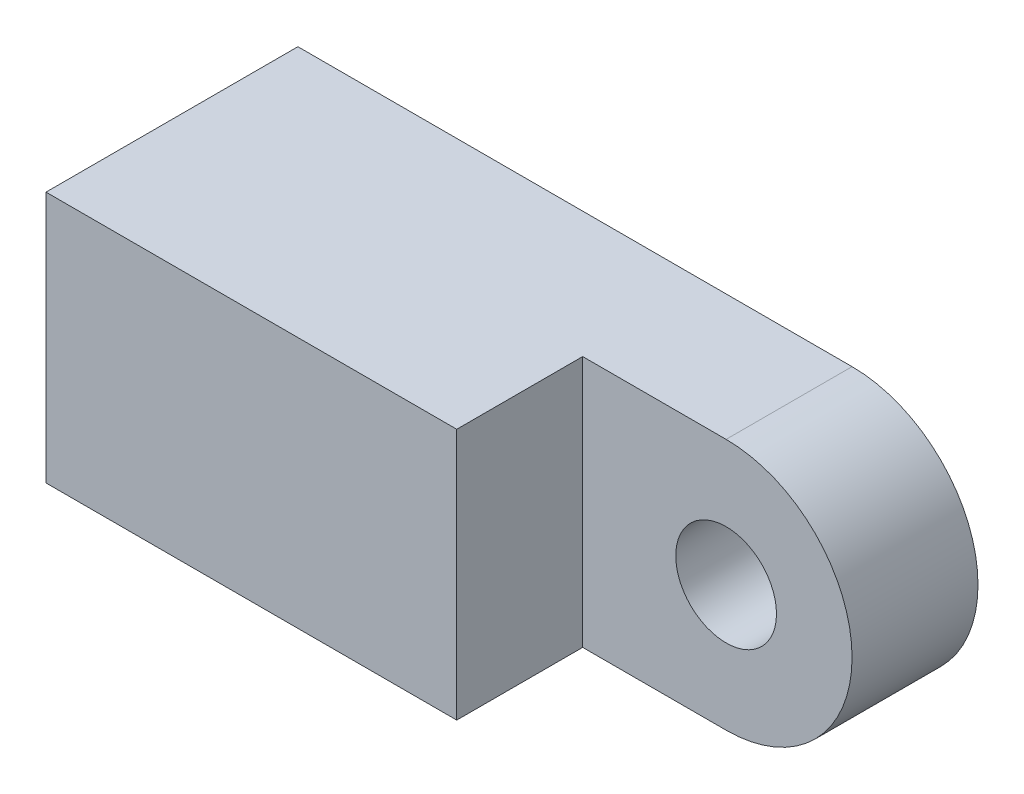
ISO-10303-21;
HEADER;
FILE_DESCRIPTION(('STEP AP214'),'2;1');
FILE_NAME('part.step','',(''),(''),'','','');
FILE_SCHEMA(('AUTOMOTIVE_DESIGN { 1 0 10303 214 1 1 1 1 }'));
ENDSEC;
DATA;
#1=APPLICATION_CONTEXT('core data for automotive mechanical design processes');
#2=APPLICATION_PROTOCOL_DEFINITION('international standard','automotive_design',2000,#1);
#3=PRODUCT_CONTEXT('',#1,'mechanical');
#4=PRODUCT('Part','Part','',(#3));
#5=PRODUCT_RELATED_PRODUCT_CATEGORY('part','',(#4));
#6=PRODUCT_DEFINITION_FORMATION('','',#4);
#7=PRODUCT_DEFINITION_CONTEXT('part definition',#1,'design');
#8=PRODUCT_DEFINITION('design','',#6,#7);
#9=PRODUCT_DEFINITION_SHAPE('','',#8);
#10=(LENGTH_UNIT() NAMED_UNIT(*) SI_UNIT(.MILLI.,.METRE.));
#11=(NAMED_UNIT(*) PLANE_ANGLE_UNIT() SI_UNIT($,.RADIAN.));
#12=(NAMED_UNIT(*) SI_UNIT($,.STERADIAN.) SOLID_ANGLE_UNIT());
#13=UNCERTAINTY_MEASURE_WITH_UNIT(LENGTH_MEASURE(1.E-05),#10,'distance_accuracy_value','');
#14=(GEOMETRIC_REPRESENTATION_CONTEXT(3) GLOBAL_UNCERTAINTY_ASSIGNED_CONTEXT((#13)) GLOBAL_UNIT_ASSIGNED_CONTEXT((#10,
#11,#12)) REPRESENTATION_CONTEXT('',''));
#15=CARTESIAN_POINT('',(0.,0.,0.));
#16=DIRECTION('',(0.,0.,1.));
#17=DIRECTION('',(1.,0.,0.));
#18=AXIS2_PLACEMENT_3D('',#15,#16,#17);
#19=CARTESIAN_POINT('',(2.,-5.89165992273422,10.));
#20=DIRECTION('',(0.,0.,-1.));
#21=DIRECTION('',(-1.,0.,0.));
#22=AXIS2_PLACEMENT_3D('',#19,#20,#21);
#23=CYLINDRICAL_SURFACE('',#22,5.);
#24=CARTESIAN_POINT('',(2.,-5.89165992273422,5.));
#25=DIRECTION('',(0.,0.,1.));
#26=DIRECTION('',(1.,0.,0.));
#27=AXIS2_PLACEMENT_3D('',#24,#25,#26);
#28=CIRCLE('',#27,5.);
#29=CARTESIAN_POINT('',(2.,-10.8916599227342,5.));
#30=VERTEX_POINT('',#29);
#31=CARTESIAN_POINT('',(2.,-0.89165992273422,5.));
#32=VERTEX_POINT('',#31);
#33=EDGE_CURVE('E114',#30,#32,#28,.T.);
#34=ORIENTED_EDGE('',*,*,#33,.F.);
#35=DIRECTION('',(0.,0.,-1.));
#36=VECTOR('',#35,1.);
#37=CARTESIAN_POINT('',(2.,-10.8916599227342,10.));
#38=LINE('',#37,#36);
#39=CARTESIAN_POINT('',(2.,-10.8916599227342,0.));
#40=VERTEX_POINT('',#39);
#41=EDGE_CURVE('E42',#30,#40,#38,.T.);
#42=ORIENTED_EDGE('',*,*,#41,.T.);
#43=CARTESIAN_POINT('',(2.,-5.89165992273422,0.));
#44=DIRECTION('',(0.,0.,1.));
#45=DIRECTION('',(1.,0.,0.));
#46=AXIS2_PLACEMENT_3D('',#43,#44,#45);
#47=CIRCLE('',#46,5.);
#48=CARTESIAN_POINT('',(2.,-0.89165992273422,0.));
#49=VERTEX_POINT('',#48);
#50=EDGE_CURVE('E90',#40,#49,#47,.T.);
#51=ORIENTED_EDGE('',*,*,#50,.T.);
#52=DIRECTION('',(0.,0.,-1.));
#53=VECTOR('',#52,1.);
#54=CARTESIAN_POINT('',(2.,-0.89165992273422,10.));
#55=LINE('',#54,#53);
#56=EDGE_CURVE('E84',#32,#49,#55,.T.);
#57=ORIENTED_EDGE('',*,*,#56,.F.);
#58=EDGE_LOOP('',(#34,#42,#51,#57));
#59=FACE_BOUND('',#58,.T.);
#60=ADVANCED_FACE('F33',(#59),#23,.T.);
#61=CARTESIAN_POINT('',(2.,-5.89165992273422,-20.));
#62=DIRECTION('',(0.,0.,1.));
#63=DIRECTION('',(1.,0.,0.));
#64=AXIS2_PLACEMENT_3D('',#61,#62,#63);
#65=CYLINDRICAL_SURFACE('',#64,2.);
#66=CARTESIAN_POINT('',(2.,-5.89165992273422,0.));
#67=DIRECTION('',(0.,0.,1.));
#68=DIRECTION('',(1.,0.,0.));
#69=AXIS2_PLACEMENT_3D('',#66,#67,#68);
#70=CIRCLE('',#69,2.);
#71=CARTESIAN_POINT('',(4.,-5.89165992273422,0.));
#72=VERTEX_POINT('',#71);
#73=EDGE_CURVE('E100',#72,#72,#70,.T.);
#74=ORIENTED_EDGE('',*,*,#73,.F.);
#75=EDGE_LOOP('',(#74));
#76=FACE_BOUND('',#75,.T.);
#77=CARTESIAN_POINT('',(2.,-5.89165992273422,5.));
#78=DIRECTION('',(0.,0.,1.));
#79=DIRECTION('',(1.,0.,0.));
#80=AXIS2_PLACEMENT_3D('',#77,#78,#79);
#81=CIRCLE('',#80,2.);
#82=CARTESIAN_POINT('',(4.,-5.89165992273422,5.));
#83=VERTEX_POINT('',#82);
#84=EDGE_CURVE('E37',#83,#83,#81,.F.);
#85=ORIENTED_EDGE('',*,*,#84,.F.);
#86=EDGE_LOOP('',(#85));
#87=FACE_BOUND('',#86,.T.);
#88=ADVANCED_FACE('F161',(#76,#87),#65,.F.);
#89=CARTESIAN_POINT('',(-20.,-0.89165992273422,10.));
#90=DIRECTION('',(1.,0.,0.));
#91=DIRECTION('',(0.,1.,0.));
#92=AXIS2_PLACEMENT_3D('',#89,#90,#91);
#93=PLANE('',#92);
#94=DIRECTION('',(0.,-1.,0.));
#95=VECTOR('',#94,1.);
#96=CARTESIAN_POINT('',(-20.,-0.89165992273422,0.));
#97=LINE('',#96,#95);
#98=CARTESIAN_POINT('',(-20.,-0.89165992273422,0.));
#99=VERTEX_POINT('',#98);
#100=CARTESIAN_POINT('',(-20.,-10.8916599227342,0.));
#101=VERTEX_POINT('',#100);
#102=EDGE_CURVE('E95',#99,#101,#97,.T.);
#103=ORIENTED_EDGE('',*,*,#102,.T.);
#104=DIRECTION('',(0.,0.,-1.));
#105=VECTOR('',#104,1.);
#106=CARTESIAN_POINT('',(-20.,-10.8916599227342,10.));
#107=LINE('',#106,#105);
#108=CARTESIAN_POINT('',(-20.,-10.8916599227342,10.));
#109=VERTEX_POINT('',#108);
#110=EDGE_CURVE('E11',#109,#101,#107,.T.);
#111=ORIENTED_EDGE('',*,*,#110,.F.);
#112=DIRECTION('',(0.,-1.,0.));
#113=VECTOR('',#112,1.);
#114=CARTESIAN_POINT('',(-20.,-0.89165992273422,10.));
#115=LINE('',#114,#113);
#116=CARTESIAN_POINT('',(-20.,-0.89165992273422,10.));
#117=VERTEX_POINT('',#116);
#118=EDGE_CURVE('E89',#117,#109,#115,.T.);
#119=ORIENTED_EDGE('',*,*,#118,.F.);
#120=DIRECTION('',(0.,0.,-1.));
#121=VECTOR('',#120,1.);
#122=CARTESIAN_POINT('',(-20.,-0.89165992273422,10.));
#123=LINE('',#122,#121);
#124=EDGE_CURVE('E80',#117,#99,#123,.T.);
#125=ORIENTED_EDGE('',*,*,#124,.T.);
#126=EDGE_LOOP('',(#103,#111,#119,#125));
#127=FACE_BOUND('',#126,.T.);
#128=ADVANCED_FACE('F35',(#127),#93,.F.);
#129=CARTESIAN_POINT('',(0.,-10.8916599227342,10.));
#130=DIRECTION('',(0.,1.,0.));
#131=DIRECTION('',(-1.,0.,0.));
#132=AXIS2_PLACEMENT_3D('',#129,#130,#131);
#133=PLANE('',#132);
#134=DIRECTION('',(1.,0.,0.));
#135=VECTOR('',#134,1.);
#136=CARTESIAN_POINT('',(0.,-10.8916599227342,5.));
#137=LINE('',#136,#135);
#138=CARTESIAN_POINT('',(-3.69367628642792,-10.8916599227342,5.));
#139=VERTEX_POINT('',#138);
#140=EDGE_CURVE('E127',#139,#30,#137,.T.);
#141=ORIENTED_EDGE('',*,*,#140,.F.);
#142=DIRECTION('',(0.,0.,1.));
#143=VECTOR('',#142,1.);
#144=CARTESIAN_POINT('',(-3.69367628642792,-10.8916599227342,10.));
#145=LINE('',#144,#143);
#146=CARTESIAN_POINT('',(-3.69367628642792,-10.8916599227342,10.));
#147=VERTEX_POINT('',#146);
#148=EDGE_CURVE('E104',#139,#147,#145,.T.);
#149=ORIENTED_EDGE('',*,*,#148,.T.);
#150=DIRECTION('',(1.,0.,0.));
#151=VECTOR('',#150,1.);
#152=CARTESIAN_POINT('',(-20.,-10.8916599227342,10.));
#153=LINE('',#152,#151);
#154=EDGE_CURVE('E120',#109,#147,#153,.T.);
#155=ORIENTED_EDGE('',*,*,#154,.F.);
#156=ORIENTED_EDGE('',*,*,#110,.T.);
#157=DIRECTION('',(1.,0.,0.));
#158=VECTOR('',#157,1.);
#159=CARTESIAN_POINT('',(0.,-10.8916599227342,0.));
#160=LINE('',#159,#158);
#161=EDGE_CURVE('E99',#101,#40,#160,.T.);
#162=ORIENTED_EDGE('',*,*,#161,.T.);
#163=ORIENTED_EDGE('',*,*,#41,.F.);
#164=EDGE_LOOP('',(#141,#149,#155,#156,#162,#163));
#165=FACE_BOUND('',#164,.T.);
#166=ADVANCED_FACE('F117',(#165),#133,.F.);
#167=CARTESIAN_POINT('',(-20.,-0.89165992273422,10.));
#168=DIRECTION('',(0.,-1.,0.));
#169=DIRECTION('',(0.,0.,-1.));
#170=AXIS2_PLACEMENT_3D('',#167,#168,#169);
#171=PLANE('',#170);
#172=DIRECTION('',(-1.,0.,0.));
#173=VECTOR('',#172,1.);
#174=CARTESIAN_POINT('',(-20.,-0.89165992273422,10.));
#175=LINE('',#174,#173);
#176=CARTESIAN_POINT('',(-3.69367628642792,-0.89165992273422,10.));
#177=VERTEX_POINT('',#176);
#178=EDGE_CURVE('E58',#177,#117,#175,.T.);
#179=ORIENTED_EDGE('',*,*,#178,.F.);
#180=DIRECTION('',(0.,0.,1.));
#181=VECTOR('',#180,1.);
#182=CARTESIAN_POINT('',(-3.69367628642792,-0.89165992273422,5.));
#183=LINE('',#182,#181);
#184=CARTESIAN_POINT('',(-3.69367628642792,-0.89165992273422,5.));
#185=VERTEX_POINT('',#184);
#186=EDGE_CURVE('E50',#185,#177,#183,.T.);
#187=ORIENTED_EDGE('',*,*,#186,.F.);
#188=DIRECTION('',(-1.,0.,0.));
#189=VECTOR('',#188,1.);
#190=CARTESIAN_POINT('',(-3.69367628642792,-0.89165992273422,5.));
#191=LINE('',#190,#189);
#192=EDGE_CURVE('E132',#32,#185,#191,.T.);
#193=ORIENTED_EDGE('',*,*,#192,.F.);
#194=ORIENTED_EDGE('',*,*,#56,.T.);
#195=DIRECTION('',(-1.,0.,0.));
#196=VECTOR('',#195,1.);
#197=CARTESIAN_POINT('',(-20.,-0.89165992273422,0.));
#198=LINE('',#197,#196);
#199=EDGE_CURVE('E77',#49,#99,#198,.T.);
#200=ORIENTED_EDGE('',*,*,#199,.T.);
#201=ORIENTED_EDGE('',*,*,#124,.F.);
#202=EDGE_LOOP('',(#179,#187,#193,#194,#200,#201));
#203=FACE_BOUND('',#202,.T.);
#204=ADVANCED_FACE('F79',(#203),#171,.F.);
#205=CARTESIAN_POINT('',(2.,-5.89165992273422,10.));
#206=DIRECTION('',(0.,0.,1.));
#207=DIRECTION('',(1.,0.,0.));
#208=AXIS2_PLACEMENT_3D('',#205,#206,#207);
#209=PLANE('',#208);
#210=DIRECTION('',(0.,-1.,0.));
#211=VECTOR('',#210,1.);
#212=CARTESIAN_POINT('',(-3.69367628642792,-0.89165992273422,10.));
#213=LINE('',#212,#211);
#214=EDGE_CURVE('E133',#177,#147,#213,.T.);
#215=ORIENTED_EDGE('',*,*,#214,.F.);
#216=ORIENTED_EDGE('',*,*,#178,.T.);
#217=ORIENTED_EDGE('',*,*,#118,.T.);
#218=ORIENTED_EDGE('',*,*,#154,.T.);
#219=EDGE_LOOP('',(#215,#216,#217,#218));
#220=FACE_BOUND('',#219,.T.);
#221=ADVANCED_FACE('F123',(#220),#209,.T.);
#222=CARTESIAN_POINT('',(2.,-5.89165992273422,0.));
#223=DIRECTION('',(0.,0.,1.));
#224=DIRECTION('',(1.,0.,0.));
#225=AXIS2_PLACEMENT_3D('',#222,#223,#224);
#226=PLANE('',#225);
#227=ORIENTED_EDGE('',*,*,#73,.T.);
#228=EDGE_LOOP('',(#227));
#229=FACE_BOUND('',#228,.T.);
#230=ORIENTED_EDGE('',*,*,#102,.F.);
#231=ORIENTED_EDGE('',*,*,#199,.F.);
#232=ORIENTED_EDGE('',*,*,#50,.F.);
#233=ORIENTED_EDGE('',*,*,#161,.F.);
#234=EDGE_LOOP('',(#230,#231,#232,#233));
#235=FACE_BOUND('',#234,.T.);
#236=ADVANCED_FACE('F97',(#229,#235),#226,.F.);
#237=CARTESIAN_POINT('',(-3.69367628642792,-0.89165992273422,5.));
#238=DIRECTION('',(-1.,0.,0.));
#239=DIRECTION('',(0.,0.,1.));
#240=AXIS2_PLACEMENT_3D('',#237,#238,#239);
#241=PLANE('',#240);
#242=DIRECTION('',(0.,-1.,0.));
#243=VECTOR('',#242,1.);
#244=CARTESIAN_POINT('',(-3.69367628642792,-0.89165992273422,5.));
#245=LINE('',#244,#243);
#246=EDGE_CURVE('E135',#185,#139,#245,.T.);
#247=ORIENTED_EDGE('',*,*,#246,.F.);
#248=ORIENTED_EDGE('',*,*,#186,.T.);
#249=ORIENTED_EDGE('',*,*,#214,.T.);
#250=ORIENTED_EDGE('',*,*,#148,.F.);
#251=EDGE_LOOP('',(#247,#248,#249,#250));
#252=FACE_BOUND('',#251,.T.);
#253=ADVANCED_FACE('F145',(#252),#241,.F.);
#254=CARTESIAN_POINT('',(0.,0.,5.));
#255=DIRECTION('',(0.,0.,1.));
#256=DIRECTION('',(1.,0.,0.));
#257=AXIS2_PLACEMENT_3D('',#254,#255,#256);
#258=PLANE('',#257);
#259=ORIENTED_EDGE('',*,*,#84,.T.);
#260=EDGE_LOOP('',(#259));
#261=FACE_BOUND('',#260,.T.);
#262=ORIENTED_EDGE('',*,*,#140,.T.);
#263=ORIENTED_EDGE('',*,*,#33,.T.);
#264=ORIENTED_EDGE('',*,*,#192,.T.);
#265=ORIENTED_EDGE('',*,*,#246,.T.);
#266=EDGE_LOOP('',(#262,#263,#264,#265));
#267=FACE_BOUND('',#266,.T.);
#268=ADVANCED_FACE('F141',(#261,#267),#258,.T.);
#269=CLOSED_SHELL('',(#60,#88,#128,#166,#204,#221,#236,#253,#268));
#270=MANIFOLD_SOLID_BREP('B2',#269);
#271=ADVANCED_BREP_SHAPE_REPRESENTATION('',(#18,#270),#14);
#272=SHAPE_DEFINITION_REPRESENTATION(#9,#271);
ENDSEC;
END-ISO-10303-21;
